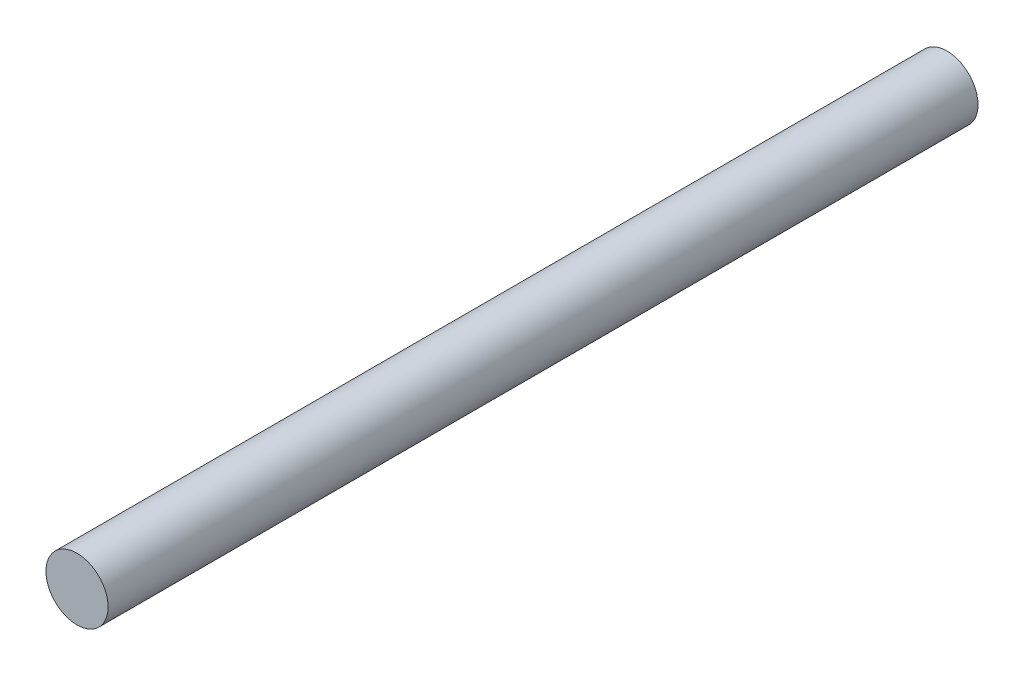
ISO-10303-21;
HEADER;
FILE_DESCRIPTION(('STEP AP214'),'2;1');
FILE_NAME('part.step','',(''),(''),'','','');
FILE_SCHEMA(('AUTOMOTIVE_DESIGN { 1 0 10303 214 1 1 1 1 }'));
ENDSEC;
DATA;
#1=APPLICATION_CONTEXT('core data for automotive mechanical design processes');
#2=APPLICATION_PROTOCOL_DEFINITION('international standard','automotive_design',2000,#1);
#3=PRODUCT_CONTEXT('',#1,'mechanical');
#4=PRODUCT('Part','Part','',(#3));
#5=PRODUCT_RELATED_PRODUCT_CATEGORY('part','',(#4));
#6=PRODUCT_DEFINITION_FORMATION('','',#4);
#7=PRODUCT_DEFINITION_CONTEXT('part definition',#1,'design');
#8=PRODUCT_DEFINITION('design','',#6,#7);
#9=PRODUCT_DEFINITION_SHAPE('','',#8);
#10=(LENGTH_UNIT() NAMED_UNIT(*) SI_UNIT(.MILLI.,.METRE.));
#11=(NAMED_UNIT(*) PLANE_ANGLE_UNIT() SI_UNIT($,.RADIAN.));
#12=(NAMED_UNIT(*) SI_UNIT($,.STERADIAN.) SOLID_ANGLE_UNIT());
#13=UNCERTAINTY_MEASURE_WITH_UNIT(LENGTH_MEASURE(1.E-05),#10,'distance_accuracy_value','');
#14=(GEOMETRIC_REPRESENTATION_CONTEXT(3) GLOBAL_UNCERTAINTY_ASSIGNED_CONTEXT((#13)) GLOBAL_UNIT_ASSIGNED_CONTEXT((#10,
#11,#12)) REPRESENTATION_CONTEXT('',''));
#15=CARTESIAN_POINT('',(0.,0.,0.));
#16=DIRECTION('',(0.,0.,1.));
#17=DIRECTION('',(1.,0.,0.));
#18=AXIS2_PLACEMENT_3D('',#15,#16,#17);
#19=CARTESIAN_POINT('',(0.,0.,44.45));
#20=DIRECTION('',(0.,0.,-1.));
#21=DIRECTION('',(-1.,0.,0.));
#22=AXIS2_PLACEMENT_3D('',#19,#20,#21);
#23=CYLINDRICAL_SURFACE('',#22,1.5875);
#24=CARTESIAN_POINT('',(0.,0.,44.45));
#25=DIRECTION('',(0.,0.,1.));
#26=DIRECTION('',(1.,0.,0.));
#27=AXIS2_PLACEMENT_3D('',#24,#25,#26);
#28=CIRCLE('',#27,1.5875);
#29=CARTESIAN_POINT('',(1.5875,0.,44.45));
#30=VERTEX_POINT('',#29);
#31=EDGE_CURVE('E10',#30,#30,#28,.T.);
#32=ORIENTED_EDGE('',*,*,#31,.F.);
#33=EDGE_LOOP('',(#32));
#34=FACE_BOUND('',#33,.T.);
#35=CARTESIAN_POINT('',(0.,0.,0.));
#36=DIRECTION('',(0.,0.,1.));
#37=DIRECTION('',(1.,0.,0.));
#38=AXIS2_PLACEMENT_3D('',#35,#36,#37);
#39=CIRCLE('',#38,1.5875);
#40=CARTESIAN_POINT('',(1.5875,0.,0.));
#41=VERTEX_POINT('',#40);
#42=EDGE_CURVE('E33',#41,#41,#39,.T.);
#43=ORIENTED_EDGE('',*,*,#42,.T.);
#44=EDGE_LOOP('',(#43));
#45=FACE_BOUND('',#44,.T.);
#46=ADVANCED_FACE('F30',(#34,#45),#23,.T.);
#47=CARTESIAN_POINT('',(0.,0.,44.45));
#48=DIRECTION('',(0.,0.,1.));
#49=DIRECTION('',(1.,0.,0.));
#50=AXIS2_PLACEMENT_3D('',#47,#48,#49);
#51=PLANE('',#50);
#52=ORIENTED_EDGE('',*,*,#31,.T.);
#53=EDGE_LOOP('',(#52));
#54=FACE_BOUND('',#53,.T.);
#55=ADVANCED_FACE('F45',(#54),#51,.T.);
#56=CARTESIAN_POINT('',(0.,0.,0.));
#57=DIRECTION('',(0.,0.,1.));
#58=DIRECTION('',(1.,0.,0.));
#59=AXIS2_PLACEMENT_3D('',#56,#57,#58);
#60=PLANE('',#59);
#61=ORIENTED_EDGE('',*,*,#42,.F.);
#62=EDGE_LOOP('',(#61));
#63=FACE_BOUND('',#62,.T.);
#64=ADVANCED_FACE('F43',(#63),#60,.F.);
#65=CLOSED_SHELL('',(#46,#55,#64));
#66=MANIFOLD_SOLID_BREP('B2',#65);
#67=ADVANCED_BREP_SHAPE_REPRESENTATION('',(#18,#66),#14);
#68=SHAPE_DEFINITION_REPRESENTATION(#9,#67);
ENDSEC;
END-ISO-10303-21;
